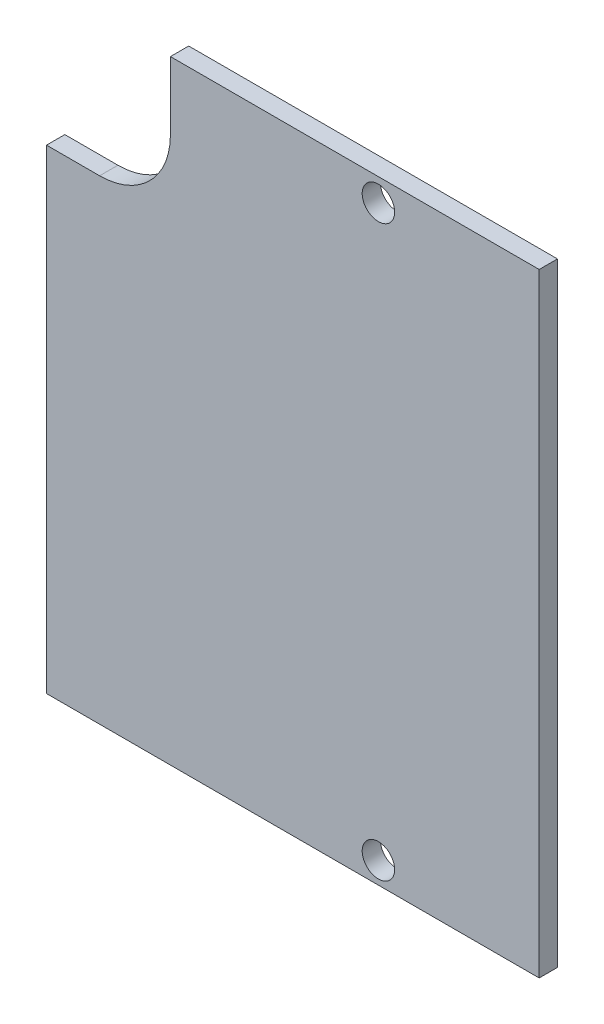
ISO-10303-21;
HEADER;
FILE_DESCRIPTION(('STEP AP214'),'2;1');
FILE_NAME('part.step','',(''),(''),'','','');
FILE_SCHEMA(('AUTOMOTIVE_DESIGN { 1 0 10303 214 1 1 1 1 }'));
ENDSEC;
DATA;
#1=APPLICATION_CONTEXT('core data for automotive mechanical design processes');
#2=APPLICATION_PROTOCOL_DEFINITION('international standard','automotive_design',2000,#1);
#3=PRODUCT_CONTEXT('',#1,'mechanical');
#4=PRODUCT('Part','Part','',(#3));
#5=PRODUCT_RELATED_PRODUCT_CATEGORY('part','',(#4));
#6=PRODUCT_DEFINITION_FORMATION('','',#4);
#7=PRODUCT_DEFINITION_CONTEXT('part definition',#1,'design');
#8=PRODUCT_DEFINITION('design','',#6,#7);
#9=PRODUCT_DEFINITION_SHAPE('','',#8);
#10=(LENGTH_UNIT() NAMED_UNIT(*) SI_UNIT(.MILLI.,.METRE.));
#11=(NAMED_UNIT(*) PLANE_ANGLE_UNIT() SI_UNIT($,.RADIAN.));
#12=(NAMED_UNIT(*) SI_UNIT($,.STERADIAN.) SOLID_ANGLE_UNIT());
#13=UNCERTAINTY_MEASURE_WITH_UNIT(LENGTH_MEASURE(1.E-05),#10,'distance_accuracy_value','');
#14=(GEOMETRIC_REPRESENTATION_CONTEXT(3) GLOBAL_UNCERTAINTY_ASSIGNED_CONTEXT((#13)) GLOBAL_UNIT_ASSIGNED_CONTEXT((#10,
#11,#12)) REPRESENTATION_CONTEXT('',''));
#15=CARTESIAN_POINT('',(0.,0.,0.));
#16=DIRECTION('',(0.,0.,1.));
#17=DIRECTION('',(1.,0.,0.));
#18=AXIS2_PLACEMENT_3D('',#15,#16,#17);
#19=CARTESIAN_POINT('',(-37.846,46.99,1.5748));
#20=DIRECTION('',(0.,0.,-1.));
#21=DIRECTION('',(-1.,0.,0.));
#22=AXIS2_PLACEMENT_3D('',#19,#20,#21);
#23=PLANE('',#22);
#24=DIRECTION('',(1.,0.,0.));
#25=VECTOR('',#24,1.);
#26=CARTESIAN_POINT('',(-42.418,0.,1.5748));
#27=LINE('',#26,#25);
#28=CARTESIAN_POINT('',(-42.418,0.,1.5748));
#29=VERTEX_POINT('',#28);
#30=CARTESIAN_POINT('',(0.,0.,1.5748));
#31=VERTEX_POINT('',#30);
#32=EDGE_CURVE('E155',#29,#31,#27,.T.);
#33=ORIENTED_EDGE('',*,*,#32,.T.);
#34=DIRECTION('',(0.,1.,0.));
#35=VECTOR('',#34,1.);
#36=CARTESIAN_POINT('',(0.,0.,1.5748));
#37=LINE('',#36,#35);
#38=CARTESIAN_POINT('',(0.,52.832,1.5748));
#39=VERTEX_POINT('',#38);
#40=EDGE_CURVE('E97',#31,#39,#37,.T.);
#41=ORIENTED_EDGE('',*,*,#40,.T.);
#42=DIRECTION('',(-1.,0.,0.));
#43=VECTOR('',#42,1.);
#44=CARTESIAN_POINT('',(0.,52.832,1.5748));
#45=LINE('',#44,#43);
#46=CARTESIAN_POINT('',(-31.75,52.832,1.5748));
#47=VERTEX_POINT('',#46);
#48=EDGE_CURVE('E172',#39,#47,#45,.T.);
#49=ORIENTED_EDGE('',*,*,#48,.T.);
#50=DIRECTION('',(0.,-1.,0.));
#51=VECTOR('',#50,1.);
#52=CARTESIAN_POINT('',(-31.75,52.832,1.5748));
#53=LINE('',#52,#51);
#54=CARTESIAN_POINT('',(-31.75,46.99,1.5748));
#55=VERTEX_POINT('',#54);
#56=EDGE_CURVE('E113',#47,#55,#53,.T.);
#57=ORIENTED_EDGE('',*,*,#56,.T.);
#58=CARTESIAN_POINT('',(-37.846,46.99,1.5748));
#59=DIRECTION('',(0.,0.,-1.));
#60=DIRECTION('',(-1.,0.,0.));
#61=AXIS2_PLACEMENT_3D('',#58,#59,#60);
#62=CIRCLE('',#61,6.096);
#63=CARTESIAN_POINT('',(-37.846,40.894,1.5748));
#64=VERTEX_POINT('',#63);
#65=EDGE_CURVE('E107',#55,#64,#62,.T.);
#66=ORIENTED_EDGE('',*,*,#65,.T.);
#67=DIRECTION('',(-1.,0.,0.));
#68=VECTOR('',#67,1.);
#69=CARTESIAN_POINT('',(-37.846,40.894,1.5748));
#70=LINE('',#69,#68);
#71=CARTESIAN_POINT('',(-42.418,40.894,1.5748));
#72=VERTEX_POINT('',#71);
#73=EDGE_CURVE('E111',#64,#72,#70,.T.);
#74=ORIENTED_EDGE('',*,*,#73,.T.);
#75=DIRECTION('',(0.,-1.,0.));
#76=VECTOR('',#75,1.);
#77=CARTESIAN_POINT('',(-42.418,40.894,1.5748));
#78=LINE('',#77,#76);
#79=EDGE_CURVE('E57',#72,#29,#78,.T.);
#80=ORIENTED_EDGE('',*,*,#79,.T.);
#81=EDGE_LOOP('',(#33,#41,#49,#57,#66,#74,#80));
#82=FACE_BOUND('',#81,.T.);
#83=CARTESIAN_POINT('',(-13.843,1.8542,1.5748));
#84=DIRECTION('',(0.,0.,1.));
#85=DIRECTION('',(1.,0.,0.));
#86=AXIS2_PLACEMENT_3D('',#83,#84,#85);
#87=CIRCLE('',#86,1.397);
#88=CARTESIAN_POINT('',(-12.446,1.8542,1.5748));
#89=VERTEX_POINT('',#88);
#90=EDGE_CURVE('E140',#89,#89,#87,.T.);
#91=ORIENTED_EDGE('',*,*,#90,.F.);
#92=EDGE_LOOP('',(#91));
#93=FACE_BOUND('',#92,.T.);
#94=CARTESIAN_POINT('',(-13.843,50.8762,1.5748));
#95=DIRECTION('',(0.,0.,1.));
#96=DIRECTION('',(1.,0.,0.));
#97=AXIS2_PLACEMENT_3D('',#94,#95,#96);
#98=CIRCLE('',#97,1.397);
#99=CARTESIAN_POINT('',(-12.446,50.8762,1.5748));
#100=VERTEX_POINT('',#99);
#101=EDGE_CURVE('E192',#100,#100,#98,.T.);
#102=ORIENTED_EDGE('',*,*,#101,.F.);
#103=EDGE_LOOP('',(#102));
#104=FACE_BOUND('',#103,.T.);
#105=ADVANCED_FACE('F39',(#82,#93,#104),#23,.F.);
#106=CARTESIAN_POINT('',(-37.846,46.99,0.));
#107=DIRECTION('',(0.,0.,-1.));
#108=DIRECTION('',(-1.,0.,0.));
#109=AXIS2_PLACEMENT_3D('',#106,#107,#108);
#110=PLANE('',#109);
#111=CARTESIAN_POINT('',(-13.843,1.8542,0.));
#112=DIRECTION('',(0.,0.,1.));
#113=DIRECTION('',(1.,0.,0.));
#114=AXIS2_PLACEMENT_3D('',#111,#112,#113);
#115=CIRCLE('',#114,1.397);
#116=CARTESIAN_POINT('',(-12.446,1.8542,0.));
#117=VERTEX_POINT('',#116);
#118=EDGE_CURVE('E188',#117,#117,#115,.T.);
#119=ORIENTED_EDGE('',*,*,#118,.T.);
#120=EDGE_LOOP('',(#119));
#121=FACE_BOUND('',#120,.T.);
#122=DIRECTION('',(1.,0.,0.));
#123=VECTOR('',#122,1.);
#124=CARTESIAN_POINT('',(-42.418,0.,0.));
#125=LINE('',#124,#123);
#126=CARTESIAN_POINT('',(-42.418,0.,0.));
#127=VERTEX_POINT('',#126);
#128=CARTESIAN_POINT('',(0.,0.,0.));
#129=VERTEX_POINT('',#128);
#130=EDGE_CURVE('E135',#127,#129,#125,.T.);
#131=ORIENTED_EDGE('',*,*,#130,.F.);
#132=DIRECTION('',(0.,-1.,0.));
#133=VECTOR('',#132,1.);
#134=CARTESIAN_POINT('',(-42.418,40.894,0.));
#135=LINE('',#134,#133);
#136=CARTESIAN_POINT('',(-42.418,40.894,0.));
#137=VERTEX_POINT('',#136);
#138=EDGE_CURVE('E89',#137,#127,#135,.T.);
#139=ORIENTED_EDGE('',*,*,#138,.F.);
#140=DIRECTION('',(-1.,0.,0.));
#141=VECTOR('',#140,1.);
#142=CARTESIAN_POINT('',(-37.846,40.894,0.));
#143=LINE('',#142,#141);
#144=CARTESIAN_POINT('',(-37.846,40.894,0.));
#145=VERTEX_POINT('',#144);
#146=EDGE_CURVE('E83',#145,#137,#143,.T.);
#147=ORIENTED_EDGE('',*,*,#146,.F.);
#148=CARTESIAN_POINT('',(-37.846,46.99,0.));
#149=DIRECTION('',(0.,0.,-1.));
#150=DIRECTION('',(-1.,0.,0.));
#151=AXIS2_PLACEMENT_3D('',#148,#149,#150);
#152=CIRCLE('',#151,6.096);
#153=CARTESIAN_POINT('',(-31.75,46.99,0.));
#154=VERTEX_POINT('',#153);
#155=EDGE_CURVE('E122',#154,#145,#152,.T.);
#156=ORIENTED_EDGE('',*,*,#155,.F.);
#157=DIRECTION('',(0.,-1.,0.));
#158=VECTOR('',#157,1.);
#159=CARTESIAN_POINT('',(-31.75,52.832,0.));
#160=LINE('',#159,#158);
#161=CARTESIAN_POINT('',(-31.75,52.832,0.));
#162=VERTEX_POINT('',#161);
#163=EDGE_CURVE('E146',#162,#154,#160,.T.);
#164=ORIENTED_EDGE('',*,*,#163,.F.);
#165=DIRECTION('',(-1.,0.,0.));
#166=VECTOR('',#165,1.);
#167=CARTESIAN_POINT('',(0.,52.832,0.));
#168=LINE('',#167,#166);
#169=CARTESIAN_POINT('',(0.,52.832,0.));
#170=VERTEX_POINT('',#169);
#171=EDGE_CURVE('E143',#170,#162,#168,.T.);
#172=ORIENTED_EDGE('',*,*,#171,.F.);
#173=DIRECTION('',(0.,1.,0.));
#174=VECTOR('',#173,1.);
#175=CARTESIAN_POINT('',(0.,0.,0.));
#176=LINE('',#175,#174);
#177=EDGE_CURVE('E139',#129,#170,#176,.T.);
#178=ORIENTED_EDGE('',*,*,#177,.F.);
#179=EDGE_LOOP('',(#131,#139,#147,#156,#164,#172,#178));
#180=FACE_BOUND('',#179,.T.);
#181=CARTESIAN_POINT('',(-13.843,50.8762,0.));
#182=DIRECTION('',(0.,0.,1.));
#183=DIRECTION('',(1.,0.,0.));
#184=AXIS2_PLACEMENT_3D('',#181,#182,#183);
#185=CIRCLE('',#184,1.397);
#186=CARTESIAN_POINT('',(-12.446,50.8762,0.));
#187=VERTEX_POINT('',#186);
#188=EDGE_CURVE('E196',#187,#187,#185,.T.);
#189=ORIENTED_EDGE('',*,*,#188,.T.);
#190=EDGE_LOOP('',(#189));
#191=FACE_BOUND('',#190,.T.);
#192=ADVANCED_FACE('F176',(#121,#180,#191),#110,.T.);
#193=CARTESIAN_POINT('',(-42.418,0.,1.5748));
#194=DIRECTION('',(0.,1.,0.));
#195=DIRECTION('',(0.,0.,1.));
#196=AXIS2_PLACEMENT_3D('',#193,#194,#195);
#197=PLANE('',#196);
#198=ORIENTED_EDGE('',*,*,#130,.T.);
#199=DIRECTION('',(0.,0.,-1.));
#200=VECTOR('',#199,1.);
#201=CARTESIAN_POINT('',(0.,0.,1.5748));
#202=LINE('',#201,#200);
#203=EDGE_CURVE('E11',#31,#129,#202,.T.);
#204=ORIENTED_EDGE('',*,*,#203,.F.);
#205=ORIENTED_EDGE('',*,*,#32,.F.);
#206=DIRECTION('',(0.,0.,-1.));
#207=VECTOR('',#206,1.);
#208=CARTESIAN_POINT('',(-42.418,0.,1.5748));
#209=LINE('',#208,#207);
#210=EDGE_CURVE('E131',#29,#127,#209,.T.);
#211=ORIENTED_EDGE('',*,*,#210,.T.);
#212=EDGE_LOOP('',(#198,#204,#205,#211));
#213=FACE_BOUND('',#212,.T.);
#214=ADVANCED_FACE('F41',(#213),#197,.F.);
#215=CARTESIAN_POINT('',(0.,0.,1.5748));
#216=DIRECTION('',(-1.,0.,0.));
#217=DIRECTION('',(0.,0.,1.));
#218=AXIS2_PLACEMENT_3D('',#215,#216,#217);
#219=PLANE('',#218);
#220=ORIENTED_EDGE('',*,*,#177,.T.);
#221=DIRECTION('',(0.,0.,-1.));
#222=VECTOR('',#221,1.);
#223=CARTESIAN_POINT('',(0.,52.832,1.5748));
#224=LINE('',#223,#222);
#225=EDGE_CURVE('E49',#39,#170,#224,.T.);
#226=ORIENTED_EDGE('',*,*,#225,.F.);
#227=ORIENTED_EDGE('',*,*,#40,.F.);
#228=ORIENTED_EDGE('',*,*,#203,.T.);
#229=EDGE_LOOP('',(#220,#226,#227,#228));
#230=FACE_BOUND('',#229,.T.);
#231=ADVANCED_FACE('F228',(#230),#219,.F.);
#232=CARTESIAN_POINT('',(0.,52.832,1.5748));
#233=DIRECTION('',(0.,-1.,0.));
#234=DIRECTION('',(1.,0.,0.));
#235=AXIS2_PLACEMENT_3D('',#232,#233,#234);
#236=PLANE('',#235);
#237=ORIENTED_EDGE('',*,*,#171,.T.);
#238=DIRECTION('',(0.,0.,-1.));
#239=VECTOR('',#238,1.);
#240=CARTESIAN_POINT('',(-31.75,52.832,1.5748));
#241=LINE('',#240,#239);
#242=EDGE_CURVE('E162',#47,#162,#241,.T.);
#243=ORIENTED_EDGE('',*,*,#242,.F.);
#244=ORIENTED_EDGE('',*,*,#48,.F.);
#245=ORIENTED_EDGE('',*,*,#225,.T.);
#246=EDGE_LOOP('',(#237,#243,#244,#245));
#247=FACE_BOUND('',#246,.T.);
#248=ADVANCED_FACE('F170',(#247),#236,.F.);
#249=CARTESIAN_POINT('',(-31.75,52.832,1.5748));
#250=DIRECTION('',(1.,0.,0.));
#251=DIRECTION('',(0.,0.,-1.));
#252=AXIS2_PLACEMENT_3D('',#249,#250,#251);
#253=PLANE('',#252);
#254=ORIENTED_EDGE('',*,*,#163,.T.);
#255=DIRECTION('',(0.,0.,-1.));
#256=VECTOR('',#255,1.);
#257=CARTESIAN_POINT('',(-31.75,46.99,1.5748));
#258=LINE('',#257,#256);
#259=EDGE_CURVE('E124',#55,#154,#258,.T.);
#260=ORIENTED_EDGE('',*,*,#259,.F.);
#261=ORIENTED_EDGE('',*,*,#56,.F.);
#262=ORIENTED_EDGE('',*,*,#242,.T.);
#263=EDGE_LOOP('',(#254,#260,#261,#262));
#264=FACE_BOUND('',#263,.T.);
#265=ADVANCED_FACE('F179',(#264),#253,.F.);
#266=CARTESIAN_POINT('',(-37.846,46.99,1.5748));
#267=DIRECTION('',(0.,0.,-1.));
#268=DIRECTION('',(-1.,0.,0.));
#269=AXIS2_PLACEMENT_3D('',#266,#267,#268);
#270=CYLINDRICAL_SURFACE('',#269,6.096);
#271=ORIENTED_EDGE('',*,*,#155,.T.);
#272=DIRECTION('',(0.,0.,-1.));
#273=VECTOR('',#272,1.);
#274=CARTESIAN_POINT('',(-37.846,40.894,1.5748));
#275=LINE('',#274,#273);
#276=EDGE_CURVE('E119',#64,#145,#275,.T.);
#277=ORIENTED_EDGE('',*,*,#276,.F.);
#278=ORIENTED_EDGE('',*,*,#65,.F.);
#279=ORIENTED_EDGE('',*,*,#259,.T.);
#280=EDGE_LOOP('',(#271,#277,#278,#279));
#281=FACE_BOUND('',#280,.T.);
#282=ADVANCED_FACE('F120',(#281),#270,.F.);
#283=CARTESIAN_POINT('',(-37.846,40.894,1.5748));
#284=DIRECTION('',(0.,-1.,0.));
#285=DIRECTION('',(0.,0.,-1.));
#286=AXIS2_PLACEMENT_3D('',#283,#284,#285);
#287=PLANE('',#286);
#288=ORIENTED_EDGE('',*,*,#146,.T.);
#289=DIRECTION('',(0.,0.,-1.));
#290=VECTOR('',#289,1.);
#291=CARTESIAN_POINT('',(-42.418,40.894,1.5748));
#292=LINE('',#291,#290);
#293=EDGE_CURVE('E125',#72,#137,#292,.T.);
#294=ORIENTED_EDGE('',*,*,#293,.F.);
#295=ORIENTED_EDGE('',*,*,#73,.F.);
#296=ORIENTED_EDGE('',*,*,#276,.T.);
#297=EDGE_LOOP('',(#288,#294,#295,#296));
#298=FACE_BOUND('',#297,.T.);
#299=ADVANCED_FACE('F127',(#298),#287,.F.);
#300=CARTESIAN_POINT('',(-42.418,40.894,1.5748));
#301=DIRECTION('',(1.,0.,0.));
#302=DIRECTION('',(0.,1.,0.));
#303=AXIS2_PLACEMENT_3D('',#300,#301,#302);
#304=PLANE('',#303);
#305=ORIENTED_EDGE('',*,*,#138,.T.);
#306=ORIENTED_EDGE('',*,*,#210,.F.);
#307=ORIENTED_EDGE('',*,*,#79,.F.);
#308=ORIENTED_EDGE('',*,*,#293,.T.);
#309=EDGE_LOOP('',(#305,#306,#307,#308));
#310=FACE_BOUND('',#309,.T.);
#311=ADVANCED_FACE('F218',(#310),#304,.F.);
#312=CARTESIAN_POINT('',(-13.843,1.8542,1.5748));
#313=DIRECTION('',(0.,0.,-1.));
#314=DIRECTION('',(-1.,0.,0.));
#315=AXIS2_PLACEMENT_3D('',#312,#313,#314);
#316=CYLINDRICAL_SURFACE('',#315,1.397);
#317=ORIENTED_EDGE('',*,*,#90,.T.);
#318=EDGE_LOOP('',(#317));
#319=FACE_BOUND('',#318,.T.);
#320=ORIENTED_EDGE('',*,*,#118,.F.);
#321=EDGE_LOOP('',(#320));
#322=FACE_BOUND('',#321,.T.);
#323=ADVANCED_FACE('F215',(#319,#322),#316,.F.);
#324=CARTESIAN_POINT('',(-13.843,50.8762,1.5748));
#325=DIRECTION('',(0.,0.,-1.));
#326=DIRECTION('',(-1.,0.,0.));
#327=AXIS2_PLACEMENT_3D('',#324,#325,#326);
#328=CYLINDRICAL_SURFACE('',#327,1.397);
#329=ORIENTED_EDGE('',*,*,#101,.T.);
#330=EDGE_LOOP('',(#329));
#331=FACE_BOUND('',#330,.T.);
#332=ORIENTED_EDGE('',*,*,#188,.F.);
#333=EDGE_LOOP('',(#332));
#334=FACE_BOUND('',#333,.T.);
#335=ADVANCED_FACE('F204',(#331,#334),#328,.F.);
#336=CLOSED_SHELL('',(#105,#192,#214,#231,#248,#265,#282,#299,#311,#323,#335));
#337=MANIFOLD_SOLID_BREP('B2',#336);
#338=ADVANCED_BREP_SHAPE_REPRESENTATION('',(#18,#337),#14);
#339=SHAPE_DEFINITION_REPRESENTATION(#9,#338);
ENDSEC;
END-ISO-10303-21;
